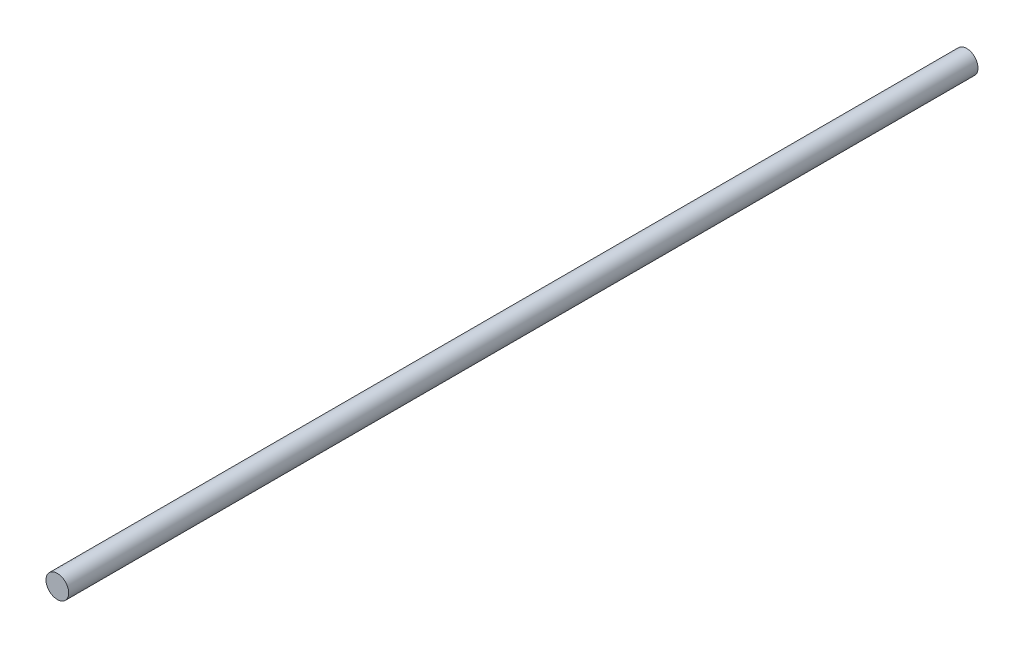
ISO-10303-21;
HEADER;
FILE_DESCRIPTION(('STEP AP214'),'2;1');
FILE_NAME('part.step','',(''),(''),'','','');
FILE_SCHEMA(('AUTOMOTIVE_DESIGN { 1 0 10303 214 1 1 1 1 }'));
ENDSEC;
DATA;
#1=APPLICATION_CONTEXT('core data for automotive mechanical design processes');
#2=APPLICATION_PROTOCOL_DEFINITION('international standard','automotive_design',2000,#1);
#3=PRODUCT_CONTEXT('',#1,'mechanical');
#4=PRODUCT('Part','Part','',(#3));
#5=PRODUCT_RELATED_PRODUCT_CATEGORY('part','',(#4));
#6=PRODUCT_DEFINITION_FORMATION('','',#4);
#7=PRODUCT_DEFINITION_CONTEXT('part definition',#1,'design');
#8=PRODUCT_DEFINITION('design','',#6,#7);
#9=PRODUCT_DEFINITION_SHAPE('','',#8);
#10=(LENGTH_UNIT() NAMED_UNIT(*) SI_UNIT(.MILLI.,.METRE.));
#11=(NAMED_UNIT(*) PLANE_ANGLE_UNIT() SI_UNIT($,.RADIAN.));
#12=(NAMED_UNIT(*) SI_UNIT($,.STERADIAN.) SOLID_ANGLE_UNIT());
#13=UNCERTAINTY_MEASURE_WITH_UNIT(LENGTH_MEASURE(1.E-05),#10,'distance_accuracy_value','');
#14=(GEOMETRIC_REPRESENTATION_CONTEXT(3) GLOBAL_UNCERTAINTY_ASSIGNED_CONTEXT((#13)) GLOBAL_UNIT_ASSIGNED_CONTEXT((#10,
#11,#12)) REPRESENTATION_CONTEXT('',''));
#15=CARTESIAN_POINT('',(0.,0.,0.));
#16=DIRECTION('',(0.,0.,1.));
#17=DIRECTION('',(1.,0.,0.));
#18=AXIS2_PLACEMENT_3D('',#15,#16,#17);
#19=CARTESIAN_POINT('',(0.,0.,508.));
#20=DIRECTION('',(0.,0.,-1.));
#21=DIRECTION('',(-1.,0.,0.));
#22=AXIS2_PLACEMENT_3D('',#19,#20,#21);
#23=CYLINDRICAL_SURFACE('',#22,6.35);
#24=CARTESIAN_POINT('',(0.,0.,508.));
#25=DIRECTION('',(0.,0.,1.));
#26=DIRECTION('',(1.,0.,0.));
#27=AXIS2_PLACEMENT_3D('',#24,#25,#26);
#28=CIRCLE('',#27,6.35);
#29=CARTESIAN_POINT('',(6.35,0.,508.));
#30=VERTEX_POINT('',#29);
#31=EDGE_CURVE('E10',#30,#30,#28,.T.);
#32=ORIENTED_EDGE('',*,*,#31,.F.);
#33=EDGE_LOOP('',(#32));
#34=FACE_BOUND('',#33,.T.);
#35=CARTESIAN_POINT('',(0.,0.,0.));
#36=DIRECTION('',(0.,0.,1.));
#37=DIRECTION('',(1.,0.,0.));
#38=AXIS2_PLACEMENT_3D('',#35,#36,#37);
#39=CIRCLE('',#38,6.35);
#40=CARTESIAN_POINT('',(6.35,0.,0.));
#41=VERTEX_POINT('',#40);
#42=EDGE_CURVE('E40',#41,#41,#39,.T.);
#43=ORIENTED_EDGE('',*,*,#42,.T.);
#44=EDGE_LOOP('',(#43));
#45=FACE_BOUND('',#44,.T.);
#46=ADVANCED_FACE('F37',(#34,#45),#23,.T.);
#47=CARTESIAN_POINT('',(0.,0.,508.));
#48=DIRECTION('',(0.,0.,1.));
#49=DIRECTION('',(1.,0.,0.));
#50=AXIS2_PLACEMENT_3D('',#47,#48,#49);
#51=PLANE('',#50);
#52=ORIENTED_EDGE('',*,*,#31,.T.);
#53=EDGE_LOOP('',(#52));
#54=FACE_BOUND('',#53,.T.);
#55=ADVANCED_FACE('F54',(#54),#51,.T.);
#56=CARTESIAN_POINT('',(0.,0.,0.));
#57=DIRECTION('',(0.,0.,1.));
#58=DIRECTION('',(1.,0.,0.));
#59=AXIS2_PLACEMENT_3D('',#56,#57,#58);
#60=PLANE('',#59);
#61=ORIENTED_EDGE('',*,*,#42,.F.);
#62=EDGE_LOOP('',(#61));
#63=FACE_BOUND('',#62,.T.);
#64=ADVANCED_FACE('F52',(#63),#60,.F.);
#65=CLOSED_SHELL('',(#46,#55,#64));
#66=MANIFOLD_SOLID_BREP('B2',#65);
#67=ADVANCED_BREP_SHAPE_REPRESENTATION('',(#18,#66),#14);
#68=SHAPE_DEFINITION_REPRESENTATION(#9,#67);
ENDSEC;
END-ISO-10303-21;
